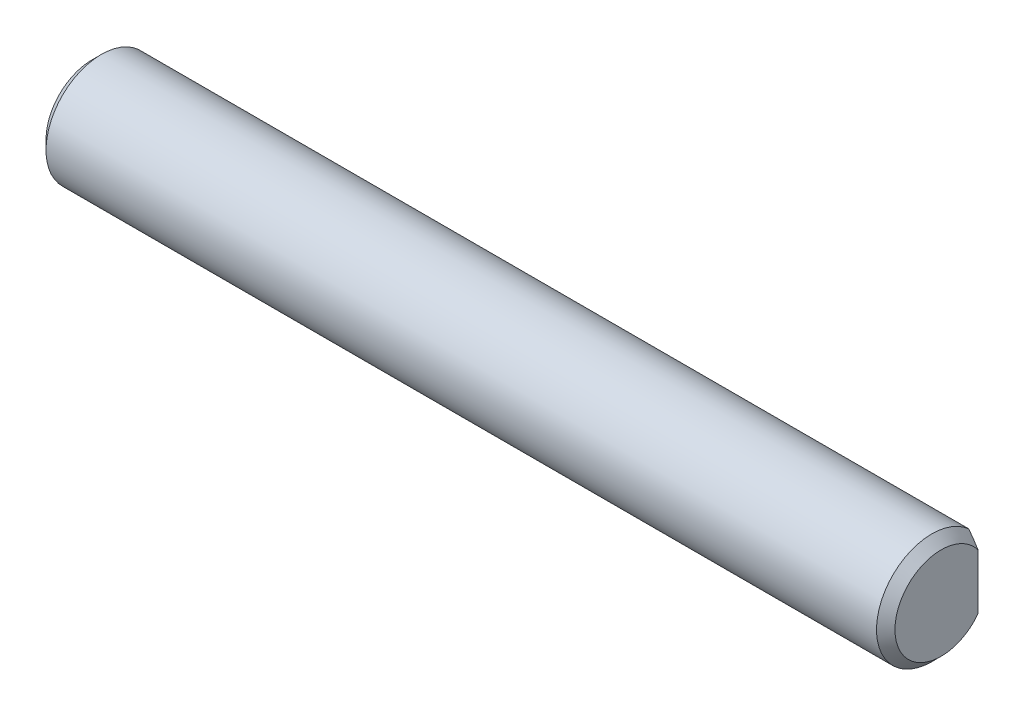
ISO-10303-21;
HEADER;
FILE_DESCRIPTION(('STEP AP214'),'2;1');
FILE_NAME('part.step','',(''),(''),'','','');
FILE_SCHEMA(('AUTOMOTIVE_DESIGN { 1 0 10303 214 1 1 1 1 }'));
ENDSEC;
DATA;
#1=APPLICATION_CONTEXT('core data for automotive mechanical design processes');
#2=APPLICATION_PROTOCOL_DEFINITION('international standard','automotive_design',2000,#1);
#3=PRODUCT_CONTEXT('',#1,'mechanical');
#4=PRODUCT('Part','Part','',(#3));
#5=PRODUCT_RELATED_PRODUCT_CATEGORY('part','',(#4));
#6=PRODUCT_DEFINITION_FORMATION('','',#4);
#7=PRODUCT_DEFINITION_CONTEXT('part definition',#1,'design');
#8=PRODUCT_DEFINITION('design','',#6,#7);
#9=PRODUCT_DEFINITION_SHAPE('','',#8);
#10=(LENGTH_UNIT() NAMED_UNIT(*) SI_UNIT(.MILLI.,.METRE.));
#11=(NAMED_UNIT(*) PLANE_ANGLE_UNIT() SI_UNIT($,.RADIAN.));
#12=(NAMED_UNIT(*) SI_UNIT($,.STERADIAN.) SOLID_ANGLE_UNIT());
#13=UNCERTAINTY_MEASURE_WITH_UNIT(LENGTH_MEASURE(1.E-05),#10,'distance_accuracy_value','');
#14=(GEOMETRIC_REPRESENTATION_CONTEXT(3) GLOBAL_UNCERTAINTY_ASSIGNED_CONTEXT((#13)) GLOBAL_UNIT_ASSIGNED_CONTEXT((#10,
#11,#12)) REPRESENTATION_CONTEXT('',''));
#15=CARTESIAN_POINT('',(0.,0.,0.));
#16=DIRECTION('',(0.,0.,1.));
#17=DIRECTION('',(1.,0.,0.));
#18=AXIS2_PLACEMENT_3D('',#15,#16,#17);
#19=CARTESIAN_POINT('',(46.,0.,0.));
#20=DIRECTION('',(-1.,0.,0.));
#21=DIRECTION('',(0.,0.,1.));
#22=AXIS2_PLACEMENT_3D('',#19,#20,#21);
#23=CYLINDRICAL_SURFACE('',#22,3.);
#24=CARTESIAN_POINT('',(45.5,0.,0.));
#25=DIRECTION('',(1.,0.,0.));
#26=DIRECTION('',(0.,0.,-1.));
#27=AXIS2_PLACEMENT_3D('',#24,#25,#26);
#28=CIRCLE('',#27,3.);
#29=CARTESIAN_POINT('',(45.5,-2.23606797749979,-2.));
#30=VERTEX_POINT('',#29);
#31=CARTESIAN_POINT('',(45.5,2.23606797749979,-2.));
#32=VERTEX_POINT('',#31);
#33=EDGE_CURVE('E109',#30,#32,#28,.F.);
#34=ORIENTED_EDGE('',*,*,#33,.T.);
#35=DIRECTION('',(-1.,0.,0.));
#36=VECTOR('',#35,1.);
#37=CARTESIAN_POINT('',(46.,2.23606797749979,-2.));
#38=LINE('',#37,#36);
#39=CARTESIAN_POINT('',(40.,2.23606797749979,-2.));
#40=VERTEX_POINT('',#39);
#41=EDGE_CURVE('E159',#32,#40,#38,.T.);
#42=ORIENTED_EDGE('',*,*,#41,.T.);
#43=CARTESIAN_POINT('',(40.,0.,0.));
#44=DIRECTION('',(-1.,0.,0.));
#45=DIRECTION('',(0.,0.,1.));
#46=AXIS2_PLACEMENT_3D('',#43,#44,#45);
#47=CIRCLE('',#46,3.);
#48=CARTESIAN_POINT('',(40.,-2.23606797749979,-2.));
#49=VERTEX_POINT('',#48);
#50=EDGE_CURVE('E122',#40,#49,#47,.T.);
#51=ORIENTED_EDGE('',*,*,#50,.T.);
#52=DIRECTION('',(-1.,0.,0.));
#53=VECTOR('',#52,1.);
#54=CARTESIAN_POINT('',(46.,-2.23606797749979,-2.));
#55=LINE('',#54,#53);
#56=EDGE_CURVE('E156',#49,#30,#55,.F.);
#57=ORIENTED_EDGE('',*,*,#56,.T.);
#58=EDGE_LOOP('',(#34,#42,#51,#57));
#59=FACE_BOUND('',#58,.T.);
#60=DIRECTION('',(-1.,0.,0.));
#61=VECTOR('',#60,1.);
#62=CARTESIAN_POINT('',(46.,-2.23606797749979,-2.));
#63=LINE('',#62,#61);
#64=CARTESIAN_POINT('',(6.,-2.23606797749979,-2.));
#65=VERTEX_POINT('',#64);
#66=CARTESIAN_POINT('',(0.500000000000007,-2.23606797749979,-2.));
#67=VERTEX_POINT('',#66);
#68=EDGE_CURVE('E55',#65,#67,#63,.T.);
#69=ORIENTED_EDGE('',*,*,#68,.F.);
#70=CARTESIAN_POINT('',(6.,0.,0.));
#71=DIRECTION('',(-1.,0.,0.));
#72=DIRECTION('',(0.,0.,1.));
#73=AXIS2_PLACEMENT_3D('',#70,#71,#72);
#74=CIRCLE('',#73,3.);
#75=CARTESIAN_POINT('',(6.,2.23606797749979,-2.));
#76=VERTEX_POINT('',#75);
#77=EDGE_CURVE('E11',#76,#65,#74,.T.);
#78=ORIENTED_EDGE('',*,*,#77,.F.);
#79=DIRECTION('',(-1.,0.,0.));
#80=VECTOR('',#79,1.);
#81=CARTESIAN_POINT('',(46.,2.23606797749979,-2.));
#82=LINE('',#81,#80);
#83=CARTESIAN_POINT('',(0.500000000000007,2.23606797749979,-2.));
#84=VERTEX_POINT('',#83);
#85=EDGE_CURVE('E148',#84,#76,#82,.F.);
#86=ORIENTED_EDGE('',*,*,#85,.F.);
#87=CARTESIAN_POINT('',(0.500000000000007,0.,0.));
#88=DIRECTION('',(1.,0.,0.));
#89=DIRECTION('',(0.,0.,-1.));
#90=AXIS2_PLACEMENT_3D('',#87,#88,#89);
#91=CIRCLE('',#90,3.);
#92=EDGE_CURVE('E106',#84,#67,#91,.T.);
#93=ORIENTED_EDGE('',*,*,#92,.T.);
#94=EDGE_LOOP('',(#69,#78,#86,#93));
#95=FACE_BOUND('',#94,.T.);
#96=ADVANCED_FACE('F38',(#59,#95),#23,.T.);
#97=CARTESIAN_POINT('',(0.,0.,0.));
#98=DIRECTION('',(1.,0.,0.));
#99=DIRECTION('',(0.,0.,-1.));
#100=AXIS2_PLACEMENT_3D('',#97,#98,#99);
#101=PLANE('',#100);
#102=DIRECTION('',(0.,-1.,0.));
#103=VECTOR('',#102,1.);
#104=CARTESIAN_POINT('',(0.,3.,-2.));
#105=LINE('',#104,#103);
#106=CARTESIAN_POINT('',(0.,1.49999999999998,-2.));
#107=VERTEX_POINT('',#106);
#108=CARTESIAN_POINT('',(0.,-1.49999999999998,-2.));
#109=VERTEX_POINT('',#108);
#110=EDGE_CURVE('E91',#107,#109,#105,.T.);
#111=ORIENTED_EDGE('',*,*,#110,.T.);
#112=CARTESIAN_POINT('',(0.,0.,0.));
#113=DIRECTION('',(1.,0.,0.));
#114=DIRECTION('',(0.,0.,-1.));
#115=AXIS2_PLACEMENT_3D('',#112,#113,#114);
#116=CIRCLE('',#115,2.49999999999999);
#117=EDGE_CURVE('E104',#109,#107,#116,.F.);
#118=ORIENTED_EDGE('',*,*,#117,.T.);
#119=EDGE_LOOP('',(#111,#118));
#120=FACE_BOUND('',#119,.T.);
#121=ADVANCED_FACE('F107',(#120),#101,.F.);
#122=CARTESIAN_POINT('',(0.500000000000007,0.,0.));
#123=DIRECTION('',(1.,0.,0.));
#124=DIRECTION('',(0.,0.,-1.));
#125=AXIS2_PLACEMENT_3D('',#122,#123,#124);
#126=CONICAL_SURFACE('',#125,3.,0.785398163397454);
#127=ORIENTED_EDGE('',*,*,#92,.F.);
#128=CARTESIAN_POINT('',(0.500700000000007,2.23700703843327,-2.));
#129=CARTESIAN_POINT('',(0.45788030330749,2.1795537550045,-2.));
#130=CARTESIAN_POINT('',(0.415514658500709,2.12175595723194,-2.));
#131=CARTESIAN_POINT('',(0.331904474610318,2.00532857151726,-2.));
#132=CARTESIAN_POINT('',(0.290660291869154,1.94669872799591,-2.));
#133=CARTESIAN_POINT('',(0.209132140854698,1.82791607476458,-2.));
#134=CARTESIAN_POINT('',(0.168861699133112,1.76775393847622,-2.));
#135=CARTESIAN_POINT('',(0.090030045068824,1.64632608074996,-2.));
#136=CARTESIAN_POINT('',(0.0514686861954003,1.58506045455726,-2.));
#137=CARTESIAN_POINT('',(-0.0255570041113596,1.45793072930445,-2.));
#138=CARTESIAN_POINT('',(-0.0639060196358888,1.39199585503251,-2.));
#139=CARTESIAN_POINT('',(-0.137645313793178,1.25849647756776,-2.));
#140=CARTESIAN_POINT('',(-0.173034958728785,1.19093162931532,-2.));
#141=CARTESIAN_POINT('',(-0.273358848503136,0.98596397106267,-2.));
#142=CARTESIAN_POINT('',(-0.33283572717098,0.845675225829986,-2.));
#143=CARTESIAN_POINT('',(-0.402985344966291,0.63367294219821,-2.));
#144=CARTESIAN_POINT('',(-0.422823476613035,0.564986427364822,-2.));
#145=CARTESIAN_POINT('',(-0.456231615326967,0.426067021922653,-2.));
#146=CARTESIAN_POINT('',(-0.469801427190934,0.355834083227667,-2.));
#147=CARTESIAN_POINT('',(-0.489579899771121,0.215656238630614,-2.));
#148=CARTESIAN_POINT('',(-0.495920993378354,0.145730344407518,-2.));
#149=CARTESIAN_POINT('',(-0.501217509734885,0.00559765577094985,-2.));
#150=CARTESIAN_POINT('',(-0.50017351503588,-0.0646091160496598,-2.));
#151=CARTESIAN_POINT('',(-0.4907870969848,-0.204457441049234,-2.));
#152=CARTESIAN_POINT('',(-0.482451335222438,-0.274099451586243,-2.));
#153=CARTESIAN_POINT('',(-0.459092417785744,-0.412243838195305,-2.));
#154=CARTESIAN_POINT('',(-0.444067903280066,-0.480745979766189,-2.));
#155=CARTESIAN_POINT('',(-0.407917020328269,-0.617448335458626,-2.));
#156=CARTESIAN_POINT('',(-0.386683260853592,-0.685619698346216,-2.));
#157=CARTESIAN_POINT('',(-0.339271159788855,-0.820190919096175,-2.));
#158=CARTESIAN_POINT('',(-0.313092906899622,-0.886590808713178,-2.));
#159=CARTESIAN_POINT('',(-0.23403599919159,-1.07054353362761,-2.));
#160=CARTESIAN_POINT('',(-0.176653682815572,-1.18615194105934,-2.));
#161=CARTESIAN_POINT('',(-0.053202363559072,-1.4127465444243,-2.));
#162=CARTESIAN_POINT('',(0.0128819320062469,-1.5237241392913,-2.));
#163=CARTESIAN_POINT('',(0.147540806534181,-1.73664107383193,-2.));
#164=CARTESIAN_POINT('',(0.215837953630035,-1.83875748602179,-2.));
#165=CARTESIAN_POINT('',(0.32095018339621,-1.98973581965621,-2.));
#166=CARTESIAN_POINT('',(0.356354483632002,-2.03959293596968,-2.));
#167=CARTESIAN_POINT('',(0.427960023491566,-2.13871944100795,-2.));
#168=CARTESIAN_POINT('',(0.46416112966594,-2.18798892605011,-2.));
#169=CARTESIAN_POINT('',(0.500700000000007,-2.23700703843327,-2.));
#170=B_SPLINE_CURVE_WITH_KNOTS('',3,(#128,#129,#130,#131,#132,#133,#134,#135,#136,#137,#138,
#139,#140,#141,#142,#143,#144,#145,#146,#147,#148,#149,#150,#151,#152,#153,#154,#155,#156,#157,
#158,#159,#160,#161,#162,#163,#164,#165,#166,#167,#168,#169),.UNSPECIFIED.,.F.,.F.,(4,2,2,2,2,2,
2,2,2,2,2,2,2,2,2,2,2,2,2,2,4),(0.,0.214969205468676,0.430005937146423,0.647168879660775,
0.864313167232134,1.09306195118812,1.3218595929074,1.77728613144309,1.99153696336322,
2.2057944668692,2.41606021515296,2.62630937740589,2.83636666125514,3.04646663808103,
3.26044016474782,3.47440985324051,3.86098427284733,4.24824735060583,4.61667573350206,
4.80011706932148,4.98352791262726),.UNSPECIFIED.);
#171=EDGE_CURVE('E48',#84,#107,#170,.T.);
#172=ORIENTED_EDGE('',*,*,#171,.T.);
#173=ORIENTED_EDGE('',*,*,#117,.F.);
#174=EDGE_CURVE('E96',#109,#67,#170,.T.);
#175=ORIENTED_EDGE('',*,*,#174,.T.);
#176=EDGE_LOOP('',(#127,#172,#173,#175));
#177=FACE_BOUND('',#176,.T.);
#178=ADVANCED_FACE('F41',(#177),#126,.T.);
#179=CARTESIAN_POINT('',(46.,0.,0.));
#180=DIRECTION('',(1.,0.,0.));
#181=DIRECTION('',(0.,0.,-1.));
#182=AXIS2_PLACEMENT_3D('',#179,#180,#181);
#183=PLANE('',#182);
#184=DIRECTION('',(0.,-1.,0.));
#185=VECTOR('',#184,1.);
#186=CARTESIAN_POINT('',(46.,3.,-2.));
#187=LINE('',#186,#185);
#188=CARTESIAN_POINT('',(46.,1.50000000000002,-2.));
#189=VERTEX_POINT('',#188);
#190=CARTESIAN_POINT('',(46.,-1.50000000000002,-2.));
#191=VERTEX_POINT('',#190);
#192=EDGE_CURVE('E63',#189,#191,#187,.T.);
#193=ORIENTED_EDGE('',*,*,#192,.F.);
#194=CARTESIAN_POINT('',(46.,0.,0.));
#195=DIRECTION('',(1.,0.,0.));
#196=DIRECTION('',(0.,0.,-1.));
#197=AXIS2_PLACEMENT_3D('',#194,#195,#196);
#198=CIRCLE('',#197,2.50000000000001);
#199=EDGE_CURVE('E161',#189,#191,#198,.T.);
#200=ORIENTED_EDGE('',*,*,#199,.T.);
#201=EDGE_LOOP('',(#193,#200));
#202=FACE_BOUND('',#201,.T.);
#203=ADVANCED_FACE('F135',(#202),#183,.T.);
#204=CARTESIAN_POINT('',(46.,0.,0.));
#205=DIRECTION('',(-1.,0.,0.));
#206=DIRECTION('',(0.,0.,1.));
#207=AXIS2_PLACEMENT_3D('',#204,#205,#206);
#208=CONICAL_SURFACE('',#207,2.50000000000001,0.785398163397447);
#209=CARTESIAN_POINT('',(45.4993,2.23700703843327,-2.));
#210=CARTESIAN_POINT('',(45.5421196966925,2.1795537550045,-2.));
#211=CARTESIAN_POINT('',(45.5844853414993,2.12175595723193,-2.));
#212=CARTESIAN_POINT('',(45.6680955253897,2.00532857151726,-2.));
#213=CARTESIAN_POINT('',(45.7093397081309,1.94669872799591,-2.));
#214=CARTESIAN_POINT('',(45.7908678591453,1.82791607476458,-2.));
#215=CARTESIAN_POINT('',(45.8311383008669,1.76775393847622,-2.));
#216=CARTESIAN_POINT('',(45.9099699549312,1.64632608074996,-2.));
#217=CARTESIAN_POINT('',(45.9485313138046,1.58506045455726,-2.));
#218=CARTESIAN_POINT('',(46.0255570041114,1.45793072930445,-2.));
#219=CARTESIAN_POINT('',(46.0639060196359,1.39199585503252,-2.));
#220=CARTESIAN_POINT('',(46.1376453137932,1.25849647756776,-2.));
#221=CARTESIAN_POINT('',(46.1730349587288,1.19093162931532,-2.));
#222=CARTESIAN_POINT('',(46.2733588485032,0.98596397106267,-2.));
#223=CARTESIAN_POINT('',(46.332835727171,0.845675225829988,-2.));
#224=CARTESIAN_POINT('',(46.4029853449663,0.633672942198213,-2.));
#225=CARTESIAN_POINT('',(46.4228234766131,0.564986427364826,-2.));
#226=CARTESIAN_POINT('',(46.456231615327,0.426067021922658,-2.));
#227=CARTESIAN_POINT('',(46.469801427191,0.355834083227674,-2.));
#228=CARTESIAN_POINT('',(46.4895798997712,0.215656238630623,-2.));
#229=CARTESIAN_POINT('',(46.4959209933784,0.145730344407527,-2.));
#230=CARTESIAN_POINT('',(46.5012175097349,0.0055976557709595,-2.));
#231=CARTESIAN_POINT('',(46.5001735150359,-0.0646091160496496,-2.));
#232=CARTESIAN_POINT('',(46.4907870969848,-0.204457441049223,-2.));
#233=CARTESIAN_POINT('',(46.4824513352225,-0.27409945158623,-2.));
#234=CARTESIAN_POINT('',(46.4590924177858,-0.412243838195292,-2.));
#235=CARTESIAN_POINT('',(46.4440679032801,-0.480745979766176,-2.));
#236=CARTESIAN_POINT('',(46.4079170203283,-0.617448335458612,-2.));
#237=CARTESIAN_POINT('',(46.3866832608536,-0.685619698346201,-2.));
#238=CARTESIAN_POINT('',(46.3392711597889,-0.820190919096157,-2.));
#239=CARTESIAN_POINT('',(46.3130929068997,-0.88659080871316,-2.));
#240=CARTESIAN_POINT('',(46.2340359991916,-1.07054353362759,-2.));
#241=CARTESIAN_POINT('',(46.1766536828156,-1.18615194105933,-2.));
#242=CARTESIAN_POINT('',(46.0532023635591,-1.4127465444243,-2.));
#243=CARTESIAN_POINT('',(45.9871180679938,-1.5237241392913,-2.));
#244=CARTESIAN_POINT('',(45.8524591934658,-1.73664107383193,-2.));
#245=CARTESIAN_POINT('',(45.78416204637,-1.83875748602178,-2.));
#246=CARTESIAN_POINT('',(45.6790498166038,-1.98973581965621,-2.));
#247=CARTESIAN_POINT('',(45.643645516368,-2.03959293596968,-2.));
#248=CARTESIAN_POINT('',(45.5720399765084,-2.13871944100795,-2.));
#249=CARTESIAN_POINT('',(45.5358388703341,-2.18798892605011,-2.));
#250=CARTESIAN_POINT('',(45.4993,-2.23700703843327,-2.));
#251=B_SPLINE_CURVE_WITH_KNOTS('',3,(#209,#210,#211,#212,#213,#214,#215,#216,#217,#218,#219,
#220,#221,#222,#223,#224,#225,#226,#227,#228,#229,#230,#231,#232,#233,#234,#235,#236,#237,#238,
#239,#240,#241,#242,#243,#244,#245,#246,#247,#248,#249,#250),.UNSPECIFIED.,.F.,.F.,(4,2,2,2,2,2,
2,2,2,2,2,2,2,2,2,2,2,2,2,2,4),(0.,0.214969205468677,0.430005937146423,0.647168879660776,
0.864313167232135,1.09306195118813,1.3218595929074,1.7772861314431,1.99153696336322,
2.20579446686919,2.41606021515296,2.62630937740589,2.83636666125513,3.04646663808102,
3.26044016474781,3.4744098532405,3.86098427284732,4.24824735060583,4.61667573350206,
4.80011706932149,4.98352791262727),.UNSPECIFIED.);
#252=EDGE_CURVE('E111',#32,#189,#251,.T.);
#253=ORIENTED_EDGE('',*,*,#252,.F.);
#254=ORIENTED_EDGE('',*,*,#33,.F.);
#255=EDGE_CURVE('E108',#191,#30,#251,.T.);
#256=ORIENTED_EDGE('',*,*,#255,.F.);
#257=ORIENTED_EDGE('',*,*,#199,.F.);
#258=EDGE_LOOP('',(#253,#254,#256,#257));
#259=FACE_BOUND('',#258,.T.);
#260=ADVANCED_FACE('F124',(#259),#208,.T.);
#261=CARTESIAN_POINT('',(40.,0.,0.));
#262=DIRECTION('',(-1.,0.,0.));
#263=DIRECTION('',(0.,0.,1.));
#264=AXIS2_PLACEMENT_3D('',#261,#262,#263);
#265=PLANE('',#264);
#266=DIRECTION('',(0.,-1.,0.));
#267=VECTOR('',#266,1.);
#268=CARTESIAN_POINT('',(40.,3.,-2.));
#269=LINE('',#268,#267);
#270=EDGE_CURVE('E153',#40,#49,#269,.T.);
#271=ORIENTED_EDGE('',*,*,#270,.T.);
#272=ORIENTED_EDGE('',*,*,#50,.F.);
#273=EDGE_LOOP('',(#271,#272));
#274=FACE_BOUND('',#273,.T.);
#275=ADVANCED_FACE('F133',(#274),#265,.F.);
#276=CARTESIAN_POINT('',(40.,3.,-2.));
#277=DIRECTION('',(0.,0.,1.));
#278=DIRECTION('',(1.,0.,0.));
#279=AXIS2_PLACEMENT_3D('',#276,#277,#278);
#280=PLANE('',#279);
#281=ORIENTED_EDGE('',*,*,#252,.T.);
#282=ORIENTED_EDGE('',*,*,#192,.T.);
#283=ORIENTED_EDGE('',*,*,#255,.T.);
#284=ORIENTED_EDGE('',*,*,#56,.F.);
#285=ORIENTED_EDGE('',*,*,#270,.F.);
#286=ORIENTED_EDGE('',*,*,#41,.F.);
#287=EDGE_LOOP('',(#281,#282,#283,#284,#285,#286));
#288=FACE_BOUND('',#287,.T.);
#289=ADVANCED_FACE('F127',(#288),#280,.F.);
#290=CARTESIAN_POINT('',(6.,0.,0.));
#291=DIRECTION('',(-1.,0.,0.));
#292=DIRECTION('',(0.,0.,1.));
#293=AXIS2_PLACEMENT_3D('',#290,#291,#292);
#294=PLANE('',#293);
#295=DIRECTION('',(0.,-1.,0.));
#296=VECTOR('',#295,1.);
#297=CARTESIAN_POINT('',(6.,3.,-2.));
#298=LINE('',#297,#296);
#299=EDGE_CURVE('E100',#76,#65,#298,.T.);
#300=ORIENTED_EDGE('',*,*,#299,.F.);
#301=ORIENTED_EDGE('',*,*,#77,.T.);
#302=EDGE_LOOP('',(#300,#301));
#303=FACE_BOUND('',#302,.T.);
#304=ADVANCED_FACE('F132',(#303),#294,.T.);
#305=CARTESIAN_POINT('',(6.,3.,-2.));
#306=DIRECTION('',(0.,0.,-1.));
#307=DIRECTION('',(-1.,0.,0.));
#308=AXIS2_PLACEMENT_3D('',#305,#306,#307);
#309=PLANE('',#308);
#310=ORIENTED_EDGE('',*,*,#85,.T.);
#311=ORIENTED_EDGE('',*,*,#299,.T.);
#312=ORIENTED_EDGE('',*,*,#68,.T.);
#313=ORIENTED_EDGE('',*,*,#174,.F.);
#314=ORIENTED_EDGE('',*,*,#110,.F.);
#315=ORIENTED_EDGE('',*,*,#171,.F.);
#316=EDGE_LOOP('',(#310,#311,#312,#313,#314,#315));
#317=FACE_BOUND('',#316,.T.);
#318=ADVANCED_FACE('F94',(#317),#309,.T.);
#319=CLOSED_SHELL('',(#96,#121,#178,#203,#260,#275,#289,#304,#318));
#320=MANIFOLD_SOLID_BREP('B2',#319);
#321=ADVANCED_BREP_SHAPE_REPRESENTATION('',(#18,#320),#14);
#322=SHAPE_DEFINITION_REPRESENTATION(#9,#321);
ENDSEC;
END-ISO-10303-21;
